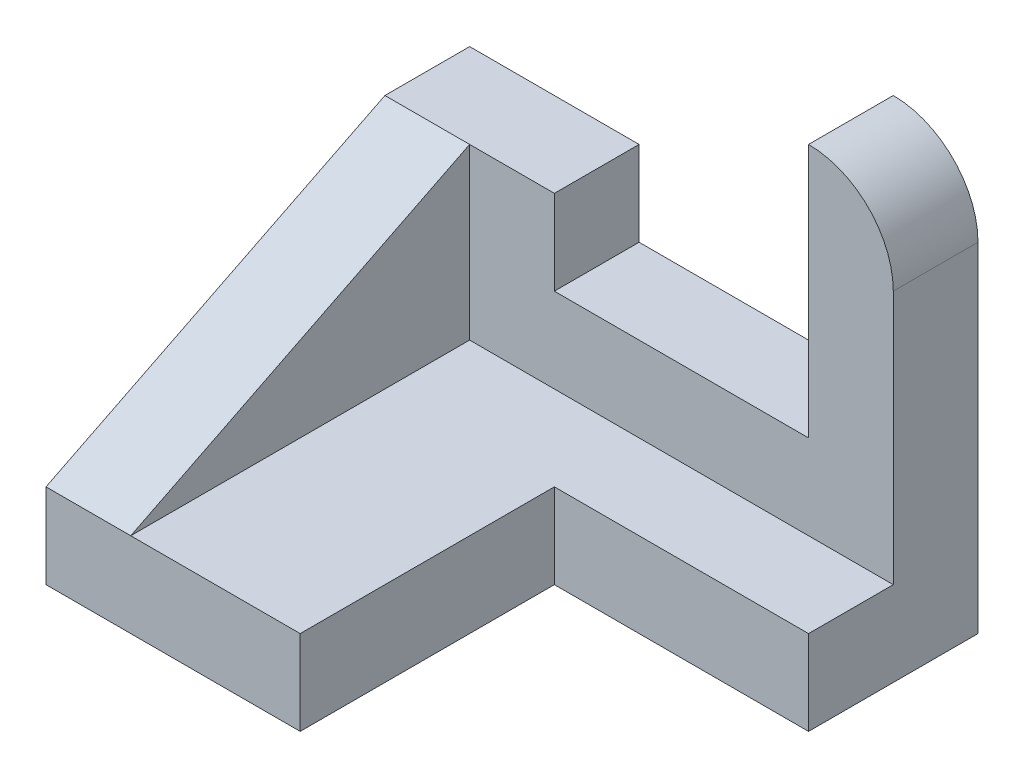
ISO-10303-21;
HEADER;
FILE_DESCRIPTION(('STEP AP214'),'2;1');
FILE_NAME('part.step','',(''),(''),'','','');
FILE_SCHEMA(('AUTOMOTIVE_DESIGN { 1 0 10303 214 1 1 1 1 }'));
ENDSEC;
DATA;
#1=APPLICATION_CONTEXT('core data for automotive mechanical design processes');
#2=APPLICATION_PROTOCOL_DEFINITION('international standard','automotive_design',2000,#1);
#3=PRODUCT_CONTEXT('',#1,'mechanical');
#4=PRODUCT('Part','Part','',(#3));
#5=PRODUCT_RELATED_PRODUCT_CATEGORY('part','',(#4));
#6=PRODUCT_DEFINITION_FORMATION('','',#4);
#7=PRODUCT_DEFINITION_CONTEXT('part definition',#1,'design');
#8=PRODUCT_DEFINITION('design','',#6,#7);
#9=PRODUCT_DEFINITION_SHAPE('','',#8);
#10=(LENGTH_UNIT() NAMED_UNIT(*) SI_UNIT(.MILLI.,.METRE.));
#11=(NAMED_UNIT(*) PLANE_ANGLE_UNIT() SI_UNIT($,.RADIAN.));
#12=(NAMED_UNIT(*) SI_UNIT($,.STERADIAN.) SOLID_ANGLE_UNIT());
#13=UNCERTAINTY_MEASURE_WITH_UNIT(LENGTH_MEASURE(1.E-05),#10,'distance_accuracy_value','');
#14=(GEOMETRIC_REPRESENTATION_CONTEXT(3) GLOBAL_UNCERTAINTY_ASSIGNED_CONTEXT((#13)) GLOBAL_UNIT_ASSIGNED_CONTEXT((#10,
#11,#12)) REPRESENTATION_CONTEXT('',''));
#15=CARTESIAN_POINT('',(0.,0.,0.));
#16=DIRECTION('',(0.,0.,1.));
#17=DIRECTION('',(1.,0.,0.));
#18=AXIS2_PLACEMENT_3D('',#15,#16,#17);
#19=CARTESIAN_POINT('',(762.,3.33066907387546E-13,1270.));
#20=DIRECTION('',(1.,0.,0.));
#21=DIRECTION('',(0.,1.,0.));
#22=AXIS2_PLACEMENT_3D('',#19,#20,#21);
#23=PLANE('',#22);
#24=DIRECTION('',(0.,-1.,0.));
#25=VECTOR('',#24,1.);
#26=CARTESIAN_POINT('',(762.,3.33066907387546E-13,508.));
#27=LINE('',#26,#25);
#28=CARTESIAN_POINT('',(762.,254.,508.));
#29=VERTEX_POINT('',#28);
#30=CARTESIAN_POINT('',(762.,0.,508.));
#31=VERTEX_POINT('',#30);
#32=EDGE_CURVE('E206',#29,#31,#27,.T.);
#33=ORIENTED_EDGE('',*,*,#32,.F.);
#34=DIRECTION('',(0.,0.,-1.));
#35=VECTOR('',#34,1.);
#36=CARTESIAN_POINT('',(762.,254.,1270.));
#37=LINE('',#36,#35);
#38=CARTESIAN_POINT('',(762.,254.,1270.));
#39=VERTEX_POINT('',#38);
#40=EDGE_CURVE('E11',#39,#29,#37,.T.);
#41=ORIENTED_EDGE('',*,*,#40,.F.);
#42=DIRECTION('',(0.,-1.,0.));
#43=VECTOR('',#42,1.);
#44=CARTESIAN_POINT('',(762.,3.33066907387546E-13,1270.));
#45=LINE('',#44,#43);
#46=CARTESIAN_POINT('',(762.,0.,1270.));
#47=VERTEX_POINT('',#46);
#48=EDGE_CURVE('E221',#39,#47,#45,.T.);
#49=ORIENTED_EDGE('',*,*,#48,.T.);
#50=DIRECTION('',(0.,0.,-1.));
#51=VECTOR('',#50,1.);
#52=CARTESIAN_POINT('',(762.,0.,1270.));
#53=LINE('',#52,#51);
#54=EDGE_CURVE('E231',#47,#31,#53,.T.);
#55=ORIENTED_EDGE('',*,*,#54,.T.);
#56=EDGE_LOOP('',(#33,#41,#49,#55));
#57=FACE_BOUND('',#56,.T.);
#58=ADVANCED_FACE('F33',(#57),#23,.T.);
#59=CARTESIAN_POINT('',(0.,254.,1270.));
#60=DIRECTION('',(0.,1.,0.));
#61=DIRECTION('',(0.,0.,1.));
#62=AXIS2_PLACEMENT_3D('',#59,#60,#61);
#63=PLANE('',#62);
#64=DIRECTION('',(0.,0.,-1.));
#65=VECTOR('',#64,1.);
#66=CARTESIAN_POINT('',(254.,254.,1270.));
#67=LINE('',#66,#65);
#68=CARTESIAN_POINT('',(254.,254.,1270.));
#69=VERTEX_POINT('',#68);
#70=CARTESIAN_POINT('',(254.,254.,254.));
#71=VERTEX_POINT('',#70);
#72=EDGE_CURVE('E147',#69,#71,#67,.T.);
#73=ORIENTED_EDGE('',*,*,#72,.F.);
#74=DIRECTION('',(1.,0.,0.));
#75=VECTOR('',#74,1.);
#76=CARTESIAN_POINT('',(0.,254.,1270.));
#77=LINE('',#76,#75);
#78=EDGE_CURVE('E224',#69,#39,#77,.T.);
#79=ORIENTED_EDGE('',*,*,#78,.T.);
#80=ORIENTED_EDGE('',*,*,#40,.T.);
#81=DIRECTION('',(1.,0.,0.));
#82=VECTOR('',#81,1.);
#83=CARTESIAN_POINT('',(0.,254.,508.));
#84=LINE('',#83,#82);
#85=CARTESIAN_POINT('',(1524.,254.,508.));
#86=VERTEX_POINT('',#85);
#87=EDGE_CURVE('E203',#29,#86,#84,.T.);
#88=ORIENTED_EDGE('',*,*,#87,.T.);
#89=DIRECTION('',(0.,0.,-1.));
#90=VECTOR('',#89,1.);
#91=CARTESIAN_POINT('',(1524.,254.,508.));
#92=LINE('',#91,#90);
#93=CARTESIAN_POINT('',(1524.,254.,254.));
#94=VERTEX_POINT('',#93);
#95=EDGE_CURVE('E213',#86,#94,#92,.T.);
#96=ORIENTED_EDGE('',*,*,#95,.T.);
#97=DIRECTION('',(1.,0.,0.));
#98=VECTOR('',#97,1.);
#99=CARTESIAN_POINT('',(0.,254.,254.));
#100=LINE('',#99,#98);
#101=EDGE_CURVE('E148',#71,#94,#100,.T.);
#102=ORIENTED_EDGE('',*,*,#101,.F.);
#103=EDGE_LOOP('',(#73,#79,#80,#88,#96,#102));
#104=FACE_BOUND('',#103,.T.);
#105=ADVANCED_FACE('F247',(#104),#63,.T.);
#106=CARTESIAN_POINT('',(0.,0.,1270.));
#107=DIRECTION('',(-1.,0.,0.));
#108=DIRECTION('',(0.,0.,1.));
#109=AXIS2_PLACEMENT_3D('',#106,#107,#108);
#110=PLANE('',#109);
#111=DIRECTION('',(0.,-0.447213595499958,0.894427190999916));
#112=VECTOR('',#111,1.);
#113=CARTESIAN_POINT('',(-4.44089209850063E-13,762.,254.));
#114=LINE('',#113,#112);
#115=CARTESIAN_POINT('',(0.,762.,254.000000000001));
#116=VERTEX_POINT('',#115);
#117=CARTESIAN_POINT('',(0.,254.,1270.));
#118=VERTEX_POINT('',#117);
#119=EDGE_CURVE('E54',#116,#118,#114,.T.);
#120=ORIENTED_EDGE('',*,*,#119,.F.);
#121=DIRECTION('',(0.,0.,-1.));
#122=VECTOR('',#121,1.);
#123=CARTESIAN_POINT('',(0.,762.,1270.));
#124=LINE('',#123,#122);
#125=CARTESIAN_POINT('',(0.,762.,0.));
#126=VERTEX_POINT('',#125);
#127=EDGE_CURVE('E154',#116,#126,#124,.T.);
#128=ORIENTED_EDGE('',*,*,#127,.T.);
#129=DIRECTION('',(0.,1.,0.));
#130=VECTOR('',#129,1.);
#131=CARTESIAN_POINT('',(0.,0.,0.));
#132=LINE('',#131,#130);
#133=CARTESIAN_POINT('',(0.,0.,0.));
#134=VERTEX_POINT('',#133);
#135=EDGE_CURVE('E220',#134,#126,#132,.T.);
#136=ORIENTED_EDGE('',*,*,#135,.F.);
#137=DIRECTION('',(0.,0.,-1.));
#138=VECTOR('',#137,1.);
#139=CARTESIAN_POINT('',(0.,0.,1270.));
#140=LINE('',#139,#138);
#141=CARTESIAN_POINT('',(0.,0.,1270.));
#142=VERTEX_POINT('',#141);
#143=EDGE_CURVE('E40',#142,#134,#140,.T.);
#144=ORIENTED_EDGE('',*,*,#143,.F.);
#145=DIRECTION('',(0.,1.,0.));
#146=VECTOR('',#145,1.);
#147=CARTESIAN_POINT('',(0.,0.,1270.));
#148=LINE('',#147,#146);
#149=EDGE_CURVE('E227',#142,#118,#148,.T.);
#150=ORIENTED_EDGE('',*,*,#149,.T.);
#151=EDGE_LOOP('',(#120,#128,#136,#144,#150));
#152=FACE_BOUND('',#151,.T.);
#153=ADVANCED_FACE('F245',(#152),#110,.T.);
#154=CARTESIAN_POINT('',(0.,0.,1270.));
#155=DIRECTION('',(0.,1.,0.));
#156=DIRECTION('',(0.,0.,1.));
#157=AXIS2_PLACEMENT_3D('',#154,#155,#156);
#158=PLANE('',#157);
#159=DIRECTION('',(1.,0.,0.));
#160=VECTOR('',#159,1.);
#161=CARTESIAN_POINT('',(0.,0.,0.));
#162=LINE('',#161,#160);
#163=CARTESIAN_POINT('',(1524.,0.,0.));
#164=VERTEX_POINT('',#163);
#165=EDGE_CURVE('E225',#134,#164,#162,.T.);
#166=ORIENTED_EDGE('',*,*,#165,.T.);
#167=DIRECTION('',(0.,0.,-1.));
#168=VECTOR('',#167,1.);
#169=CARTESIAN_POINT('',(1524.,0.,508.));
#170=LINE('',#169,#168);
#171=CARTESIAN_POINT('',(1524.,0.,508.));
#172=VERTEX_POINT('',#171);
#173=EDGE_CURVE('E217',#172,#164,#170,.T.);
#174=ORIENTED_EDGE('',*,*,#173,.F.);
#175=DIRECTION('',(1.,0.,0.));
#176=VECTOR('',#175,1.);
#177=CARTESIAN_POINT('',(0.,0.,508.));
#178=LINE('',#177,#176);
#179=EDGE_CURVE('E209',#31,#172,#178,.T.);
#180=ORIENTED_EDGE('',*,*,#179,.F.);
#181=ORIENTED_EDGE('',*,*,#54,.F.);
#182=DIRECTION('',(1.,0.,0.));
#183=VECTOR('',#182,1.);
#184=CARTESIAN_POINT('',(0.,0.,1270.));
#185=LINE('',#184,#183);
#186=EDGE_CURVE('E229',#142,#47,#185,.T.);
#187=ORIENTED_EDGE('',*,*,#186,.F.);
#188=ORIENTED_EDGE('',*,*,#143,.T.);
#189=EDGE_LOOP('',(#166,#174,#180,#181,#187,#188));
#190=FACE_BOUND('',#189,.T.);
#191=ADVANCED_FACE('F238',(#190),#158,.F.);
#192=CARTESIAN_POINT('',(0.,0.,1270.));
#193=DIRECTION('',(0.,0.,1.));
#194=DIRECTION('',(1.,0.,0.));
#195=AXIS2_PLACEMENT_3D('',#192,#193,#194);
#196=PLANE('',#195);
#197=DIRECTION('',(-1.,0.,0.));
#198=VECTOR('',#197,1.);
#199=CARTESIAN_POINT('',(3833.37387270648,254.,1270.));
#200=LINE('',#199,#198);
#201=EDGE_CURVE('E47',#69,#118,#200,.T.);
#202=ORIENTED_EDGE('',*,*,#201,.T.);
#203=ORIENTED_EDGE('',*,*,#149,.F.);
#204=ORIENTED_EDGE('',*,*,#186,.T.);
#205=ORIENTED_EDGE('',*,*,#48,.F.);
#206=ORIENTED_EDGE('',*,*,#78,.F.);
#207=EDGE_LOOP('',(#202,#203,#204,#205,#206));
#208=FACE_BOUND('',#207,.T.);
#209=ADVANCED_FACE('F253',(#208),#196,.T.);
#210=CARTESIAN_POINT('',(0.,0.,0.));
#211=DIRECTION('',(0.,0.,1.));
#212=DIRECTION('',(1.,0.,0.));
#213=AXIS2_PLACEMENT_3D('',#210,#211,#212);
#214=PLANE('',#213);
#215=ORIENTED_EDGE('',*,*,#135,.T.);
#216=DIRECTION('',(1.,0.,0.));
#217=VECTOR('',#216,1.);
#218=CARTESIAN_POINT('',(-1.66533453693773E-13,762.,0.));
#219=LINE('',#218,#217);
#220=CARTESIAN_POINT('',(508.,762.,0.));
#221=VERTEX_POINT('',#220);
#222=EDGE_CURVE('E168',#126,#221,#219,.T.);
#223=ORIENTED_EDGE('',*,*,#222,.T.);
#224=DIRECTION('',(0.,-1.,0.));
#225=VECTOR('',#224,1.);
#226=CARTESIAN_POINT('',(508.,2.22044604925031E-13,0.));
#227=LINE('',#226,#225);
#228=CARTESIAN_POINT('',(508.,508.,0.));
#229=VERTEX_POINT('',#228);
#230=EDGE_CURVE('E187',#221,#229,#227,.T.);
#231=ORIENTED_EDGE('',*,*,#230,.T.);
#232=DIRECTION('',(1.,0.,0.));
#233=VECTOR('',#232,1.);
#234=CARTESIAN_POINT('',(0.,508.,0.));
#235=LINE('',#234,#233);
#236=CARTESIAN_POINT('',(1270.,508.,0.));
#237=VERTEX_POINT('',#236);
#238=EDGE_CURVE('E184',#229,#237,#235,.T.);
#239=ORIENTED_EDGE('',*,*,#238,.T.);
#240=DIRECTION('',(0.,1.,0.));
#241=VECTOR('',#240,1.);
#242=CARTESIAN_POINT('',(1270.,0.,0.));
#243=LINE('',#242,#241);
#244=CARTESIAN_POINT('',(1270.,1270.,0.));
#245=VERTEX_POINT('',#244);
#246=EDGE_CURVE('E181',#237,#245,#243,.T.);
#247=ORIENTED_EDGE('',*,*,#246,.T.);
#248=CARTESIAN_POINT('',(1270.,1015.99999904396,0.));
#249=DIRECTION('',(0.,0.,1.));
#250=DIRECTION('',(1.,0.,0.));
#251=AXIS2_PLACEMENT_3D('',#248,#249,#250);
#252=CIRCLE('',#251,254.000000478018);
#253=CARTESIAN_POINT('',(1524.,1015.99999904396,0.));
#254=VERTEX_POINT('',#253);
#255=EDGE_CURVE('E163',#245,#254,#252,.F.);
#256=ORIENTED_EDGE('',*,*,#255,.T.);
#257=DIRECTION('',(0.,1.,0.));
#258=VECTOR('',#257,1.);
#259=CARTESIAN_POINT('',(1524.,0.,0.));
#260=LINE('',#259,#258);
#261=EDGE_CURVE('E202',#164,#254,#260,.T.);
#262=ORIENTED_EDGE('',*,*,#261,.F.);
#263=ORIENTED_EDGE('',*,*,#165,.F.);
#264=EDGE_LOOP('',(#215,#223,#231,#239,#247,#256,#262,#263));
#265=FACE_BOUND('',#264,.T.);
#266=ADVANCED_FACE('F244',(#265),#214,.F.);
#267=CARTESIAN_POINT('',(1524.,0.,508.));
#268=DIRECTION('',(-1.,0.,0.));
#269=DIRECTION('',(0.,0.,1.));
#270=AXIS2_PLACEMENT_3D('',#267,#268,#269);
#271=PLANE('',#270);
#272=ORIENTED_EDGE('',*,*,#261,.T.);
#273=DIRECTION('',(0.,0.,-1.));
#274=VECTOR('',#273,1.);
#275=CARTESIAN_POINT('',(1524.,1015.99999904396,254.));
#276=LINE('',#275,#274);
#277=CARTESIAN_POINT('',(1524.,1015.99999904396,254.));
#278=VERTEX_POINT('',#277);
#279=EDGE_CURVE('E178',#278,#254,#276,.T.);
#280=ORIENTED_EDGE('',*,*,#279,.F.);
#281=DIRECTION('',(0.,1.,0.));
#282=VECTOR('',#281,1.);
#283=CARTESIAN_POINT('',(1524.,0.,254.));
#284=LINE('',#283,#282);
#285=EDGE_CURVE('E176',#94,#278,#284,.T.);
#286=ORIENTED_EDGE('',*,*,#285,.F.);
#287=ORIENTED_EDGE('',*,*,#95,.F.);
#288=DIRECTION('',(0.,1.,0.));
#289=VECTOR('',#288,1.);
#290=CARTESIAN_POINT('',(1524.,0.,508.));
#291=LINE('',#290,#289);
#292=EDGE_CURVE('E211',#172,#86,#291,.T.);
#293=ORIENTED_EDGE('',*,*,#292,.F.);
#294=ORIENTED_EDGE('',*,*,#173,.T.);
#295=EDGE_LOOP('',(#272,#280,#286,#287,#293,#294));
#296=FACE_BOUND('',#295,.T.);
#297=ADVANCED_FACE('F270',(#296),#271,.F.);
#298=CARTESIAN_POINT('',(0.,0.,508.));
#299=DIRECTION('',(0.,0.,1.));
#300=DIRECTION('',(1.,0.,0.));
#301=AXIS2_PLACEMENT_3D('',#298,#299,#300);
#302=PLANE('',#301);
#303=ORIENTED_EDGE('',*,*,#87,.F.);
#304=ORIENTED_EDGE('',*,*,#32,.T.);
#305=ORIENTED_EDGE('',*,*,#179,.T.);
#306=ORIENTED_EDGE('',*,*,#292,.T.);
#307=EDGE_LOOP('',(#303,#304,#305,#306));
#308=FACE_BOUND('',#307,.T.);
#309=ADVANCED_FACE('F265',(#308),#302,.T.);
#310=CARTESIAN_POINT('',(1270.,1015.99999904396,254.));
#311=DIRECTION('',(0.,0.,-1.));
#312=DIRECTION('',(-1.,0.,0.));
#313=AXIS2_PLACEMENT_3D('',#310,#311,#312);
#314=CYLINDRICAL_SURFACE('',#313,254.000000478018);
#315=ORIENTED_EDGE('',*,*,#255,.F.);
#316=DIRECTION('',(0.,0.,-1.));
#317=VECTOR('',#316,1.);
#318=CARTESIAN_POINT('',(1270.,1270.,254.));
#319=LINE('',#318,#317);
#320=CARTESIAN_POINT('',(1270.,1270.,254.));
#321=VERTEX_POINT('',#320);
#322=EDGE_CURVE('E200',#321,#245,#319,.T.);
#323=ORIENTED_EDGE('',*,*,#322,.F.);
#324=CARTESIAN_POINT('',(1270.,1015.99999904396,254.));
#325=DIRECTION('',(0.,0.,1.));
#326=DIRECTION('',(1.,0.,0.));
#327=AXIS2_PLACEMENT_3D('',#324,#325,#326);
#328=CIRCLE('',#327,254.000000478018);
#329=EDGE_CURVE('E164',#321,#278,#328,.F.);
#330=ORIENTED_EDGE('',*,*,#329,.T.);
#331=ORIENTED_EDGE('',*,*,#279,.T.);
#332=EDGE_LOOP('',(#315,#323,#330,#331));
#333=FACE_BOUND('',#332,.T.);
#334=ADVANCED_FACE('F275',(#333),#314,.T.);
#335=CARTESIAN_POINT('',(1270.,0.,254.));
#336=DIRECTION('',(-1.,0.,0.));
#337=DIRECTION('',(0.,0.,1.));
#338=AXIS2_PLACEMENT_3D('',#335,#336,#337);
#339=PLANE('',#338);
#340=ORIENTED_EDGE('',*,*,#246,.F.);
#341=DIRECTION('',(0.,0.,-1.));
#342=VECTOR('',#341,1.);
#343=CARTESIAN_POINT('',(1270.,508.,254.));
#344=LINE('',#343,#342);
#345=CARTESIAN_POINT('',(1270.,508.,254.));
#346=VERTEX_POINT('',#345);
#347=EDGE_CURVE('E198',#346,#237,#344,.T.);
#348=ORIENTED_EDGE('',*,*,#347,.F.);
#349=DIRECTION('',(0.,1.,0.));
#350=VECTOR('',#349,1.);
#351=CARTESIAN_POINT('',(1270.,0.,254.));
#352=LINE('',#351,#350);
#353=EDGE_CURVE('E167',#346,#321,#352,.T.);
#354=ORIENTED_EDGE('',*,*,#353,.T.);
#355=ORIENTED_EDGE('',*,*,#322,.T.);
#356=EDGE_LOOP('',(#340,#348,#354,#355));
#357=FACE_BOUND('',#356,.T.);
#358=ADVANCED_FACE('F278',(#357),#339,.T.);
#359=CARTESIAN_POINT('',(0.,508.,254.));
#360=DIRECTION('',(0.,1.,0.));
#361=DIRECTION('',(0.,0.,1.));
#362=AXIS2_PLACEMENT_3D('',#359,#360,#361);
#363=PLANE('',#362);
#364=ORIENTED_EDGE('',*,*,#238,.F.);
#365=DIRECTION('',(0.,0.,-1.));
#366=VECTOR('',#365,1.);
#367=CARTESIAN_POINT('',(508.,508.,254.));
#368=LINE('',#367,#366);
#369=CARTESIAN_POINT('',(508.,508.,254.));
#370=VERTEX_POINT('',#369);
#371=EDGE_CURVE('E196',#370,#229,#368,.T.);
#372=ORIENTED_EDGE('',*,*,#371,.F.);
#373=DIRECTION('',(1.,0.,0.));
#374=VECTOR('',#373,1.);
#375=CARTESIAN_POINT('',(0.,508.,254.));
#376=LINE('',#375,#374);
#377=EDGE_CURVE('E171',#370,#346,#376,.T.);
#378=ORIENTED_EDGE('',*,*,#377,.T.);
#379=ORIENTED_EDGE('',*,*,#347,.T.);
#380=EDGE_LOOP('',(#364,#372,#378,#379));
#381=FACE_BOUND('',#380,.T.);
#382=ADVANCED_FACE('F281',(#381),#363,.T.);
#383=CARTESIAN_POINT('',(508.,2.22044604925031E-13,254.));
#384=DIRECTION('',(1.,0.,0.));
#385=DIRECTION('',(0.,1.,0.));
#386=AXIS2_PLACEMENT_3D('',#383,#384,#385);
#387=PLANE('',#386);
#388=ORIENTED_EDGE('',*,*,#230,.F.);
#389=DIRECTION('',(0.,0.,-1.));
#390=VECTOR('',#389,1.);
#391=CARTESIAN_POINT('',(508.,762.,254.));
#392=LINE('',#391,#390);
#393=CARTESIAN_POINT('',(508.,762.,254.));
#394=VERTEX_POINT('',#393);
#395=EDGE_CURVE('E194',#394,#221,#392,.T.);
#396=ORIENTED_EDGE('',*,*,#395,.F.);
#397=DIRECTION('',(0.,-1.,0.));
#398=VECTOR('',#397,1.);
#399=CARTESIAN_POINT('',(508.,2.22044604925031E-13,254.));
#400=LINE('',#399,#398);
#401=EDGE_CURVE('E138',#394,#370,#400,.T.);
#402=ORIENTED_EDGE('',*,*,#401,.T.);
#403=ORIENTED_EDGE('',*,*,#371,.T.);
#404=EDGE_LOOP('',(#388,#396,#402,#403));
#405=FACE_BOUND('',#404,.T.);
#406=ADVANCED_FACE('F284',(#405),#387,.T.);
#407=CARTESIAN_POINT('',(-1.66533453693773E-13,762.,254.));
#408=DIRECTION('',(0.,1.,0.));
#409=DIRECTION('',(-1.,0.,0.));
#410=AXIS2_PLACEMENT_3D('',#407,#408,#409);
#411=PLANE('',#410);
#412=DIRECTION('',(-1.,0.,0.));
#413=VECTOR('',#412,1.);
#414=CARTESIAN_POINT('',(3833.37387270648,762.000000000001,254.));
#415=LINE('',#414,#413);
#416=CARTESIAN_POINT('',(254.,762.,254.));
#417=VERTEX_POINT('',#416);
#418=EDGE_CURVE('E151',#417,#116,#415,.T.);
#419=ORIENTED_EDGE('',*,*,#418,.F.);
#420=DIRECTION('',(1.,0.,0.));
#421=VECTOR('',#420,1.);
#422=CARTESIAN_POINT('',(-1.66533453693773E-13,762.,254.));
#423=LINE('',#422,#421);
#424=EDGE_CURVE('E130',#417,#394,#423,.T.);
#425=ORIENTED_EDGE('',*,*,#424,.T.);
#426=ORIENTED_EDGE('',*,*,#395,.T.);
#427=ORIENTED_EDGE('',*,*,#222,.F.);
#428=ORIENTED_EDGE('',*,*,#127,.F.);
#429=EDGE_LOOP('',(#419,#425,#426,#427,#428));
#430=FACE_BOUND('',#429,.T.);
#431=ADVANCED_FACE('F152',(#430),#411,.T.);
#432=CARTESIAN_POINT('',(0.,0.,254.));
#433=DIRECTION('',(0.,0.,1.));
#434=DIRECTION('',(1.,0.,0.));
#435=AXIS2_PLACEMENT_3D('',#432,#433,#434);
#436=PLANE('',#435);
#437=ORIENTED_EDGE('',*,*,#329,.F.);
#438=ORIENTED_EDGE('',*,*,#353,.F.);
#439=ORIENTED_EDGE('',*,*,#377,.F.);
#440=ORIENTED_EDGE('',*,*,#401,.F.);
#441=ORIENTED_EDGE('',*,*,#424,.F.);
#442=DIRECTION('',(0.,-1.,0.));
#443=VECTOR('',#442,1.);
#444=CARTESIAN_POINT('',(254.,0.,254.));
#445=LINE('',#444,#443);
#446=EDGE_CURVE('E134',#417,#71,#445,.T.);
#447=ORIENTED_EDGE('',*,*,#446,.T.);
#448=ORIENTED_EDGE('',*,*,#101,.T.);
#449=ORIENTED_EDGE('',*,*,#285,.T.);
#450=EDGE_LOOP('',(#437,#438,#439,#440,#441,#447,#448,#449));
#451=FACE_BOUND('',#450,.T.);
#452=ADVANCED_FACE('F133',(#451),#436,.T.);
#453=CARTESIAN_POINT('',(254.,0.,1270.));
#454=DIRECTION('',(1.,0.,0.));
#455=DIRECTION('',(0.,1.,0.));
#456=AXIS2_PLACEMENT_3D('',#453,#454,#455);
#457=PLANE('',#456);
#458=DIRECTION('',(0.,-0.447213595499958,0.894427190999916));
#459=VECTOR('',#458,1.);
#460=CARTESIAN_POINT('',(254.,762.,254.));
#461=LINE('',#460,#459);
#462=EDGE_CURVE('E145',#417,#69,#461,.T.);
#463=ORIENTED_EDGE('',*,*,#462,.T.);
#464=ORIENTED_EDGE('',*,*,#72,.T.);
#465=ORIENTED_EDGE('',*,*,#446,.F.);
#466=EDGE_LOOP('',(#463,#464,#465));
#467=FACE_BOUND('',#466,.T.);
#468=ADVANCED_FACE('F143',(#467),#457,.T.);
#469=CARTESIAN_POINT('',(3833.37387270648,762.000000000001,254.));
#470=DIRECTION('',(0.,-0.894427190999916,-0.447213595499958));
#471=DIRECTION('',(0.,0.447213595499958,-0.894427190999916));
#472=AXIS2_PLACEMENT_3D('',#469,#470,#471);
#473=PLANE('',#472);
#474=ORIENTED_EDGE('',*,*,#418,.T.);
#475=ORIENTED_EDGE('',*,*,#119,.T.);
#476=ORIENTED_EDGE('',*,*,#201,.F.);
#477=ORIENTED_EDGE('',*,*,#462,.F.);
#478=EDGE_LOOP('',(#474,#475,#476,#477));
#479=FACE_BOUND('',#478,.T.);
#480=ADVANCED_FACE('F157',(#479),#473,.F.);
#481=CLOSED_SHELL('',(#58,#105,#153,#191,#209,#266,#297,#309,#334,#358,#382,#406,#431,#452,#468,#480));
#482=MANIFOLD_SOLID_BREP('B2',#481);
#483=ADVANCED_BREP_SHAPE_REPRESENTATION('',(#18,#482),#14);
#484=SHAPE_DEFINITION_REPRESENTATION(#9,#483);
ENDSEC;
END-ISO-10303-21;
